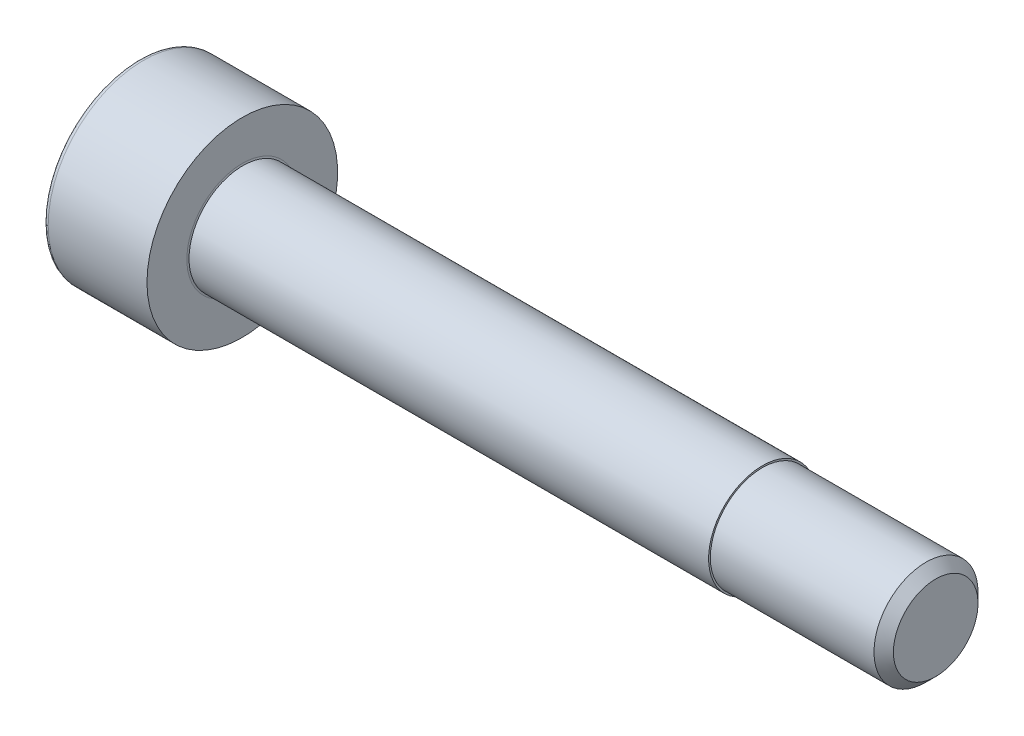
ISO-10303-21;
HEADER;
FILE_DESCRIPTION(('STEP AP214'),'2;1');
FILE_NAME('part.step','',(''),(''),'','','');
FILE_SCHEMA(('AUTOMOTIVE_DESIGN { 1 0 10303 214 1 1 1 1 }'));
ENDSEC;
DATA;
#1=APPLICATION_CONTEXT('core data for automotive mechanical design processes');
#2=APPLICATION_PROTOCOL_DEFINITION('international standard','automotive_design',2000,#1);
#3=PRODUCT_CONTEXT('',#1,'mechanical');
#4=PRODUCT('Part','Part','',(#3));
#5=PRODUCT_RELATED_PRODUCT_CATEGORY('part','',(#4));
#6=PRODUCT_DEFINITION_FORMATION('','',#4);
#7=PRODUCT_DEFINITION_CONTEXT('part definition',#1,'design');
#8=PRODUCT_DEFINITION('design','',#6,#7);
#9=PRODUCT_DEFINITION_SHAPE('','',#8);
#10=(LENGTH_UNIT() NAMED_UNIT(*) SI_UNIT(.MILLI.,.METRE.));
#11=(NAMED_UNIT(*) PLANE_ANGLE_UNIT() SI_UNIT($,.RADIAN.));
#12=(NAMED_UNIT(*) SI_UNIT($,.STERADIAN.) SOLID_ANGLE_UNIT());
#13=UNCERTAINTY_MEASURE_WITH_UNIT(LENGTH_MEASURE(1.E-05),#10,'distance_accuracy_value','');
#14=(GEOMETRIC_REPRESENTATION_CONTEXT(3) GLOBAL_UNCERTAINTY_ASSIGNED_CONTEXT((#13)) GLOBAL_UNIT_ASSIGNED_CONTEXT((#10,
#11,#12)) REPRESENTATION_CONTEXT('',''));
#15=CARTESIAN_POINT('',(0.,0.,0.));
#16=DIRECTION('',(0.,0.,1.));
#17=DIRECTION('',(1.,0.,0.));
#18=AXIS2_PLACEMENT_3D('',#15,#16,#17);
#19=CARTESIAN_POINT('',(3.1,0.,0.));
#20=DIRECTION('',(1.,0.,0.));
#21=DIRECTION('',(0.,0.,-1.));
#22=AXIS2_PLACEMENT_3D('',#19,#20,#21);
#23=TOROIDAL_SURFACE('',#22,1.59999999999999,0.1);
#24=CARTESIAN_POINT('',(3.,0.,0.));
#25=DIRECTION('',(1.,0.,0.));
#26=DIRECTION('',(0.,0.,-1.));
#27=AXIS2_PLACEMENT_3D('',#24,#25,#26);
#28=CIRCLE('',#27,1.59999999999999);
#29=CARTESIAN_POINT('',(3.,0.,-1.59999999999999));
#30=VERTEX_POINT('',#29);
#31=EDGE_CURVE('E152',#30,#30,#28,.F.);
#32=ORIENTED_EDGE('',*,*,#31,.F.);
#33=EDGE_LOOP('',(#32));
#34=FACE_BOUND('',#33,.T.);
#35=CARTESIAN_POINT('',(3.01339745962155,0.,0.));
#36=DIRECTION('',(1.,0.,0.));
#37=DIRECTION('',(0.,0.,-1.));
#38=AXIS2_PLACEMENT_3D('',#35,#36,#37);
#39=CIRCLE('',#38,1.55);
#40=CARTESIAN_POINT('',(3.01339745962155,0.,-1.55));
#41=VERTEX_POINT('',#40);
#42=EDGE_CURVE('E43',#41,#41,#39,.T.);
#43=ORIENTED_EDGE('',*,*,#42,.F.);
#44=EDGE_LOOP('',(#43));
#45=FACE_BOUND('',#44,.T.);
#46=ADVANCED_FACE('F35',(#34,#45),#23,.F.);
#47=CARTESIAN_POINT('',(0.,0.,0.));
#48=DIRECTION('',(-1.,0.,0.));
#49=DIRECTION('',(0.,0.,1.));
#50=AXIS2_PLACEMENT_3D('',#47,#48,#49);
#51=PLANE('',#50);
#52=DIRECTION('',(0.,-0.499999999999999,0.866025403784439));
#53=VECTOR('',#52,1.);
#54=CARTESIAN_POINT('',(0.,1.47801668912544,0.));
#55=LINE('',#54,#53);
#56=CARTESIAN_POINT('',(0.,1.47801668912544,0.));
#57=VERTEX_POINT('',#56);
#58=CARTESIAN_POINT('',(0.,0.73900834456272,1.28));
#59=VERTEX_POINT('',#58);
#60=EDGE_CURVE('E239',#57,#59,#55,.T.);
#61=ORIENTED_EDGE('',*,*,#60,.T.);
#62=DIRECTION('',(0.,1.,0.));
#63=VECTOR('',#62,1.);
#64=CARTESIAN_POINT('',(0.,-0.739008344562723,1.28));
#65=LINE('',#64,#63);
#66=CARTESIAN_POINT('',(0.,-0.739008344562723,1.28));
#67=VERTEX_POINT('',#66);
#68=EDGE_CURVE('E131',#67,#59,#65,.T.);
#69=ORIENTED_EDGE('',*,*,#68,.F.);
#70=DIRECTION('',(0.,-0.500000000000001,-0.866025403784438));
#71=VECTOR('',#70,1.);
#72=CARTESIAN_POINT('',(0.,-0.739008344562723,1.28));
#73=LINE('',#72,#71);
#74=CARTESIAN_POINT('',(0.,-1.47801668912545,0.));
#75=VERTEX_POINT('',#74);
#76=EDGE_CURVE('E259',#67,#75,#73,.T.);
#77=ORIENTED_EDGE('',*,*,#76,.T.);
#78=DIRECTION('',(0.,0.499999999999999,-0.866025403784439));
#79=VECTOR('',#78,1.);
#80=CARTESIAN_POINT('',(0.,-1.47801668912545,0.));
#81=LINE('',#80,#79);
#82=CARTESIAN_POINT('',(0.,-0.739008344562727,-1.28));
#83=VERTEX_POINT('',#82);
#84=EDGE_CURVE('E262',#75,#83,#81,.T.);
#85=ORIENTED_EDGE('',*,*,#84,.T.);
#86=DIRECTION('',(0.,-1.,0.));
#87=VECTOR('',#86,1.);
#88=CARTESIAN_POINT('',(0.,0.739008344562717,-1.28));
#89=LINE('',#88,#87);
#90=CARTESIAN_POINT('',(0.,0.739008344562717,-1.28));
#91=VERTEX_POINT('',#90);
#92=EDGE_CURVE('E265',#91,#83,#89,.T.);
#93=ORIENTED_EDGE('',*,*,#92,.F.);
#94=DIRECTION('',(0.,-0.500000000000001,-0.866025403784438));
#95=VECTOR('',#94,1.);
#96=CARTESIAN_POINT('',(0.,1.47801668912544,0.));
#97=LINE('',#96,#95);
#98=EDGE_CURVE('E126',#57,#91,#97,.T.);
#99=ORIENTED_EDGE('',*,*,#98,.F.);
#100=EDGE_LOOP('',(#61,#69,#77,#85,#93,#99));
#101=FACE_BOUND('',#100,.T.);
#102=CARTESIAN_POINT('',(0.,0.,0.));
#103=DIRECTION('',(-1.,0.,0.));
#104=DIRECTION('',(0.,0.,1.));
#105=AXIS2_PLACEMENT_3D('',#102,#103,#104);
#106=CIRCLE('',#105,2.6);
#107=CARTESIAN_POINT('',(0.,0.,2.6));
#108=VERTEX_POINT('',#107);
#109=EDGE_CURVE('E155',#108,#108,#106,.T.);
#110=ORIENTED_EDGE('',*,*,#109,.T.);
#111=EDGE_LOOP('',(#110));
#112=FACE_BOUND('',#111,.T.);
#113=ADVANCED_FACE('F166',(#101,#112),#51,.T.);
#114=CARTESIAN_POINT('',(-31.75,0.,0.));
#115=DIRECTION('',(-1.,0.,0.));
#116=DIRECTION('',(0.,0.,1.));
#117=AXIS2_PLACEMENT_3D('',#114,#115,#116);
#118=CYLINDRICAL_SURFACE('',#117,2.75);
#119=CARTESIAN_POINT('',(0.149999999999997,0.,0.));
#120=DIRECTION('',(-1.,0.,0.));
#121=DIRECTION('',(0.,0.,1.));
#122=AXIS2_PLACEMENT_3D('',#119,#120,#121);
#123=CIRCLE('',#122,2.75);
#124=CARTESIAN_POINT('',(0.149999999999997,0.,2.75));
#125=VERTEX_POINT('',#124);
#126=EDGE_CURVE('E158',#125,#125,#123,.F.);
#127=ORIENTED_EDGE('',*,*,#126,.T.);
#128=EDGE_LOOP('',(#127));
#129=FACE_BOUND('',#128,.T.);
#130=CARTESIAN_POINT('',(3.,0.,0.));
#131=DIRECTION('',(-1.,0.,0.));
#132=DIRECTION('',(0.,0.,1.));
#133=AXIS2_PLACEMENT_3D('',#130,#131,#132);
#134=CIRCLE('',#133,2.75);
#135=CARTESIAN_POINT('',(3.,0.,2.75));
#136=VERTEX_POINT('',#135);
#137=EDGE_CURVE('E149',#136,#136,#134,.T.);
#138=ORIENTED_EDGE('',*,*,#137,.T.);
#139=EDGE_LOOP('',(#138));
#140=FACE_BOUND('',#139,.T.);
#141=ADVANCED_FACE('F173',(#129,#140),#118,.T.);
#142=CARTESIAN_POINT('',(3.,2.75,0.));
#143=DIRECTION('',(1.,0.,0.));
#144=DIRECTION('',(0.,0.,-1.));
#145=AXIS2_PLACEMENT_3D('',#142,#143,#144);
#146=PLANE('',#145);
#147=ORIENTED_EDGE('',*,*,#31,.T.);
#148=EDGE_LOOP('',(#147));
#149=FACE_BOUND('',#148,.T.);
#150=ORIENTED_EDGE('',*,*,#137,.F.);
#151=EDGE_LOOP('',(#150));
#152=FACE_BOUND('',#151,.T.);
#153=ADVANCED_FACE('F180',(#149,#152),#146,.T.);
#154=CARTESIAN_POINT('',(0.149999999999997,0.,0.));
#155=DIRECTION('',(-1.,0.,0.));
#156=DIRECTION('',(0.,0.,1.));
#157=AXIS2_PLACEMENT_3D('',#154,#155,#156);
#158=TOROIDAL_SURFACE('',#157,2.6,0.15);
#159=ORIENTED_EDGE('',*,*,#126,.F.);
#160=EDGE_LOOP('',(#159));
#161=FACE_BOUND('',#160,.T.);
#162=ORIENTED_EDGE('',*,*,#109,.F.);
#163=EDGE_LOOP('',(#162));
#164=FACE_BOUND('',#163,.T.);
#165=ADVANCED_FACE('F37',(#161,#164),#158,.T.);
#166=CARTESIAN_POINT('',(1.3,1.47801668912544,0.));
#167=DIRECTION('',(0.,-0.866025403784439,-0.499999999999999));
#168=DIRECTION('',(0.,0.499999999999999,-0.866025403784439));
#169=AXIS2_PLACEMENT_3D('',#166,#167,#168);
#170=PLANE('',#169);
#171=ORIENTED_EDGE('',*,*,#60,.F.);
#172=DIRECTION('',(-1.,0.,0.));
#173=VECTOR('',#172,1.);
#174=CARTESIAN_POINT('',(1.3,1.47801668912544,0.));
#175=LINE('',#174,#173);
#176=CARTESIAN_POINT('',(1.3,1.47801668912544,0.));
#177=VERTEX_POINT('',#176);
#178=EDGE_CURVE('E256',#177,#57,#175,.T.);
#179=ORIENTED_EDGE('',*,*,#178,.F.);
#180=DIRECTION('',(0.,-0.499999999999999,0.866025403784439));
#181=VECTOR('',#180,1.);
#182=CARTESIAN_POINT('',(1.3,1.47801668912544,0.));
#183=LINE('',#182,#181);
#184=CARTESIAN_POINT('',(1.3,1.10851251684408,0.639999999999997));
#185=VERTEX_POINT('',#184);
#186=EDGE_CURVE('E118',#177,#185,#183,.T.);
#187=ORIENTED_EDGE('',*,*,#186,.T.);
#188=CARTESIAN_POINT('',(1.3,0.73900834456272,1.28));
#189=VERTEX_POINT('',#188);
#190=EDGE_CURVE('E109',#185,#189,#183,.T.);
#191=ORIENTED_EDGE('',*,*,#190,.T.);
#192=DIRECTION('',(-1.,0.,0.));
#193=VECTOR('',#192,1.);
#194=CARTESIAN_POINT('',(1.3,0.73900834456272,1.28));
#195=LINE('',#194,#193);
#196=EDGE_CURVE('E123',#189,#59,#195,.T.);
#197=ORIENTED_EDGE('',*,*,#196,.T.);
#198=EDGE_LOOP('',(#171,#179,#187,#191,#197));
#199=FACE_BOUND('',#198,.T.);
#200=ADVANCED_FACE('F122',(#199),#170,.T.);
#201=CARTESIAN_POINT('',(1.3,-0.739008344562723,1.28));
#202=DIRECTION('',(0.,0.,1.));
#203=DIRECTION('',(0.,-1.,0.));
#204=AXIS2_PLACEMENT_3D('',#201,#202,#203);
#205=PLANE('',#204);
#206=ORIENTED_EDGE('',*,*,#68,.T.);
#207=ORIENTED_EDGE('',*,*,#196,.F.);
#208=DIRECTION('',(0.,1.,0.));
#209=VECTOR('',#208,1.);
#210=CARTESIAN_POINT('',(1.3,-0.739008344562723,1.28));
#211=LINE('',#210,#209);
#212=CARTESIAN_POINT('',(1.3,0.,1.28));
#213=VERTEX_POINT('',#212);
#214=EDGE_CURVE('E106',#213,#189,#211,.T.);
#215=ORIENTED_EDGE('',*,*,#214,.F.);
#216=CARTESIAN_POINT('',(1.3,-0.739008344562723,1.28));
#217=VERTEX_POINT('',#216);
#218=EDGE_CURVE('E117',#217,#213,#211,.T.);
#219=ORIENTED_EDGE('',*,*,#218,.F.);
#220=DIRECTION('',(-1.,0.,0.));
#221=VECTOR('',#220,1.);
#222=CARTESIAN_POINT('',(1.3,-0.739008344562723,1.28));
#223=LINE('',#222,#221);
#224=EDGE_CURVE('E133',#217,#67,#223,.T.);
#225=ORIENTED_EDGE('',*,*,#224,.T.);
#226=EDGE_LOOP('',(#206,#207,#215,#219,#225));
#227=FACE_BOUND('',#226,.T.);
#228=ADVANCED_FACE('F128',(#227),#205,.F.);
#229=CARTESIAN_POINT('',(1.3,-0.739008344562723,1.28));
#230=DIRECTION('',(0.,0.866025403784438,-0.500000000000001));
#231=DIRECTION('',(0.,0.500000000000001,0.866025403784438));
#232=AXIS2_PLACEMENT_3D('',#229,#230,#231);
#233=PLANE('',#232);
#234=ORIENTED_EDGE('',*,*,#76,.F.);
#235=ORIENTED_EDGE('',*,*,#224,.F.);
#236=DIRECTION('',(0.,-0.500000000000001,-0.866025403784438));
#237=VECTOR('',#236,1.);
#238=CARTESIAN_POINT('',(1.3,-0.739008344562723,1.28));
#239=LINE('',#238,#237);
#240=CARTESIAN_POINT('',(1.3,-1.10851251684408,0.640000000000002));
#241=VERTEX_POINT('',#240);
#242=EDGE_CURVE('E244',#217,#241,#239,.T.);
#243=ORIENTED_EDGE('',*,*,#242,.T.);
#244=CARTESIAN_POINT('',(1.3,-1.47801668912545,0.));
#245=VERTEX_POINT('',#244);
#246=EDGE_CURVE('E243',#241,#245,#239,.T.);
#247=ORIENTED_EDGE('',*,*,#246,.T.);
#248=DIRECTION('',(-1.,0.,0.));
#249=VECTOR('',#248,1.);
#250=CARTESIAN_POINT('',(1.3,-1.47801668912545,0.));
#251=LINE('',#250,#249);
#252=EDGE_CURVE('E138',#245,#75,#251,.T.);
#253=ORIENTED_EDGE('',*,*,#252,.T.);
#254=EDGE_LOOP('',(#234,#235,#243,#247,#253));
#255=FACE_BOUND('',#254,.T.);
#256=ADVANCED_FACE('F206',(#255),#233,.T.);
#257=CARTESIAN_POINT('',(1.3,-1.47801668912545,0.));
#258=DIRECTION('',(0.,0.866025403784439,0.499999999999999));
#259=DIRECTION('',(0.,-0.499999999999999,0.866025403784439));
#260=AXIS2_PLACEMENT_3D('',#257,#258,#259);
#261=PLANE('',#260);
#262=ORIENTED_EDGE('',*,*,#84,.F.);
#263=ORIENTED_EDGE('',*,*,#252,.F.);
#264=DIRECTION('',(0.,0.499999999999999,-0.866025403784439));
#265=VECTOR('',#264,1.);
#266=CARTESIAN_POINT('',(1.3,-1.47801668912545,0.));
#267=LINE('',#266,#265);
#268=CARTESIAN_POINT('',(1.3,-1.10851251684409,-0.640000000000001));
#269=VERTEX_POINT('',#268);
#270=EDGE_CURVE('E248',#245,#269,#267,.T.);
#271=ORIENTED_EDGE('',*,*,#270,.T.);
#272=CARTESIAN_POINT('',(1.3,-0.739008344562727,-1.28));
#273=VERTEX_POINT('',#272);
#274=EDGE_CURVE('E247',#269,#273,#267,.T.);
#275=ORIENTED_EDGE('',*,*,#274,.T.);
#276=DIRECTION('',(-1.,0.,0.));
#277=VECTOR('',#276,1.);
#278=CARTESIAN_POINT('',(1.3,-0.739008344562727,-1.28));
#279=LINE('',#278,#277);
#280=EDGE_CURVE('E274',#273,#83,#279,.T.);
#281=ORIENTED_EDGE('',*,*,#280,.T.);
#282=EDGE_LOOP('',(#262,#263,#271,#275,#281));
#283=FACE_BOUND('',#282,.T.);
#284=ADVANCED_FACE('F209',(#283),#261,.T.);
#285=CARTESIAN_POINT('',(1.3,0.739008344562717,-1.28));
#286=DIRECTION('',(0.,0.,-1.));
#287=DIRECTION('',(0.,1.,0.));
#288=AXIS2_PLACEMENT_3D('',#285,#286,#287);
#289=PLANE('',#288);
#290=ORIENTED_EDGE('',*,*,#92,.T.);
#291=ORIENTED_EDGE('',*,*,#280,.F.);
#292=DIRECTION('',(0.,-1.,0.));
#293=VECTOR('',#292,1.);
#294=CARTESIAN_POINT('',(1.3,0.739008344562717,-1.28));
#295=LINE('',#294,#293);
#296=CARTESIAN_POINT('',(1.3,0.,-1.28));
#297=VERTEX_POINT('',#296);
#298=EDGE_CURVE('E251',#297,#273,#295,.T.);
#299=ORIENTED_EDGE('',*,*,#298,.F.);
#300=CARTESIAN_POINT('',(1.3,0.739008344562717,-1.28));
#301=VERTEX_POINT('',#300);
#302=EDGE_CURVE('E50',#301,#297,#295,.T.);
#303=ORIENTED_EDGE('',*,*,#302,.F.);
#304=DIRECTION('',(-1.,0.,0.));
#305=VECTOR('',#304,1.);
#306=CARTESIAN_POINT('',(1.3,0.739008344562717,-1.28));
#307=LINE('',#306,#305);
#308=EDGE_CURVE('E271',#301,#91,#307,.T.);
#309=ORIENTED_EDGE('',*,*,#308,.T.);
#310=EDGE_LOOP('',(#290,#291,#299,#303,#309));
#311=FACE_BOUND('',#310,.T.);
#312=ADVANCED_FACE('F213',(#311),#289,.F.);
#313=CARTESIAN_POINT('',(1.3,1.47801668912544,0.));
#314=DIRECTION('',(0.,0.866025403784438,-0.500000000000001));
#315=DIRECTION('',(0.,0.500000000000001,0.866025403784438));
#316=AXIS2_PLACEMENT_3D('',#313,#314,#315);
#317=PLANE('',#316);
#318=ORIENTED_EDGE('',*,*,#98,.T.);
#319=ORIENTED_EDGE('',*,*,#308,.F.);
#320=DIRECTION('',(0.,-0.500000000000001,-0.866025403784438));
#321=VECTOR('',#320,1.);
#322=CARTESIAN_POINT('',(1.3,1.47801668912544,0.));
#323=LINE('',#322,#321);
#324=CARTESIAN_POINT('',(1.3,1.10851251684408,-0.640000000000001));
#325=VERTEX_POINT('',#324);
#326=EDGE_CURVE('E253',#325,#301,#323,.T.);
#327=ORIENTED_EDGE('',*,*,#326,.F.);
#328=EDGE_CURVE('E254',#177,#325,#323,.T.);
#329=ORIENTED_EDGE('',*,*,#328,.F.);
#330=ORIENTED_EDGE('',*,*,#178,.T.);
#331=EDGE_LOOP('',(#318,#319,#327,#329,#330));
#332=FACE_BOUND('',#331,.T.);
#333=ADVANCED_FACE('F217',(#332),#317,.F.);
#334=CARTESIAN_POINT('',(1.3,1.47801668912544,0.));
#335=DIRECTION('',(1.,0.,0.));
#336=DIRECTION('',(0.,0.,-1.));
#337=AXIS2_PLACEMENT_3D('',#334,#335,#336);
#338=PLANE('',#337);
#339=ORIENTED_EDGE('',*,*,#298,.T.);
#340=ORIENTED_EDGE('',*,*,#274,.F.);
#341=CARTESIAN_POINT('',(1.3,0.,0.));
#342=DIRECTION('',(-1.,0.,0.));
#343=DIRECTION('',(0.,0.,1.));
#344=AXIS2_PLACEMENT_3D('',#341,#342,#343);
#345=CIRCLE('',#344,1.28);
#346=EDGE_CURVE('E292',#297,#269,#345,.T.);
#347=ORIENTED_EDGE('',*,*,#346,.F.);
#348=EDGE_LOOP('',(#339,#340,#347));
#349=FACE_BOUND('',#348,.T.);
#350=ADVANCED_FACE('F221',(#349),#338,.F.);
#351=ORIENTED_EDGE('',*,*,#270,.F.);
#352=ORIENTED_EDGE('',*,*,#246,.F.);
#353=EDGE_CURVE('E136',#269,#241,#345,.T.);
#354=ORIENTED_EDGE('',*,*,#353,.F.);
#355=EDGE_LOOP('',(#351,#352,#354));
#356=FACE_BOUND('',#355,.T.);
#357=ADVANCED_FACE('F225',(#356),#338,.F.);
#358=ORIENTED_EDGE('',*,*,#242,.F.);
#359=ORIENTED_EDGE('',*,*,#218,.T.);
#360=EDGE_CURVE('E132',#241,#213,#345,.T.);
#361=ORIENTED_EDGE('',*,*,#360,.F.);
#362=EDGE_LOOP('',(#358,#359,#361));
#363=FACE_BOUND('',#362,.T.);
#364=ADVANCED_FACE('F301',(#363),#338,.F.);
#365=ORIENTED_EDGE('',*,*,#214,.T.);
#366=ORIENTED_EDGE('',*,*,#190,.F.);
#367=EDGE_CURVE('E112',#213,#185,#345,.T.);
#368=ORIENTED_EDGE('',*,*,#367,.F.);
#369=EDGE_LOOP('',(#365,#366,#368));
#370=FACE_BOUND('',#369,.T.);
#371=ADVANCED_FACE('F108',(#370),#338,.F.);
#372=ORIENTED_EDGE('',*,*,#186,.F.);
#373=ORIENTED_EDGE('',*,*,#328,.T.);
#374=EDGE_CURVE('E143',#185,#325,#345,.T.);
#375=ORIENTED_EDGE('',*,*,#374,.F.);
#376=EDGE_LOOP('',(#372,#373,#375));
#377=FACE_BOUND('',#376,.T.);
#378=ADVANCED_FACE('F287',(#377),#338,.F.);
#379=ORIENTED_EDGE('',*,*,#326,.T.);
#380=ORIENTED_EDGE('',*,*,#302,.T.);
#381=EDGE_CURVE('E291',#325,#297,#345,.T.);
#382=ORIENTED_EDGE('',*,*,#381,.F.);
#383=EDGE_LOOP('',(#379,#380,#382));
#384=FACE_BOUND('',#383,.T.);
#385=ADVANCED_FACE('F201',(#384),#338,.F.);
#386=CARTESIAN_POINT('',(1.3,0.,0.));
#387=DIRECTION('',(-1.,0.,0.));
#388=DIRECTION('',(0.,0.,1.));
#389=AXIS2_PLACEMENT_3D('',#386,#387,#388);
#390=CONICAL_SURFACE('',#389,1.28,1.04719755119659);
#391=CARTESIAN_POINT('',(2.03900834456273,0.,0.));
#392=VERTEX_POINT('',#391);
#393=VERTEX_LOOP('',#392);
#394=FACE_BOUND('',#393,.T.);
#395=ORIENTED_EDGE('',*,*,#367,.T.);
#396=ORIENTED_EDGE('',*,*,#374,.T.);
#397=ORIENTED_EDGE('',*,*,#381,.T.);
#398=ORIENTED_EDGE('',*,*,#346,.T.);
#399=ORIENTED_EDGE('',*,*,#353,.T.);
#400=ORIENTED_EDGE('',*,*,#360,.T.);
#401=EDGE_LOOP('',(#395,#396,#397,#398,#399,#400));
#402=FACE_BOUND('',#401,.T.);
#403=ADVANCED_FACE('F198',(#394,#402),#390,.F.);
#404=CARTESIAN_POINT('',(18.,0.,0.));
#405=DIRECTION('',(-1.,0.,0.));
#406=DIRECTION('',(0.,0.,1.));
#407=AXIS2_PLACEMENT_3D('',#404,#405,#406);
#408=CYLINDRICAL_SURFACE('',#407,1.55);
#409=CARTESIAN_POINT('',(18.,0.,0.));
#410=DIRECTION('',(1.,0.,0.));
#411=DIRECTION('',(0.,0.,-1.));
#412=AXIS2_PLACEMENT_3D('',#409,#410,#411);
#413=CIRCLE('',#412,1.55);
#414=CARTESIAN_POINT('',(18.,0.,-1.55));
#415=VERTEX_POINT('',#414);
#416=EDGE_CURVE('E238',#415,#415,#413,.T.);
#417=ORIENTED_EDGE('',*,*,#416,.F.);
#418=EDGE_LOOP('',(#417));
#419=FACE_BOUND('',#418,.T.);
#420=ORIENTED_EDGE('',*,*,#42,.T.);
#421=EDGE_LOOP('',(#420));
#422=FACE_BOUND('',#421,.T.);
#423=ADVANCED_FACE('F163',(#419,#422),#408,.T.);
#424=CARTESIAN_POINT('',(18.,0.,0.));
#425=DIRECTION('',(1.,0.,0.));
#426=DIRECTION('',(0.,0.,-1.));
#427=AXIS2_PLACEMENT_3D('',#424,#425,#426);
#428=PLANE('',#427);
#429=CARTESIAN_POINT('',(18.,0.,0.));
#430=DIRECTION('',(1.,0.,0.));
#431=DIRECTION('',(0.,0.,-1.));
#432=AXIS2_PLACEMENT_3D('',#429,#430,#431);
#433=CIRCLE('',#432,1.49999999999999);
#434=CARTESIAN_POINT('',(18.,0.,-1.49999999999999));
#435=VERTEX_POINT('',#434);
#436=EDGE_CURVE('E11',#435,#435,#433,.F.);
#437=ORIENTED_EDGE('',*,*,#436,.T.);
#438=EDGE_LOOP('',(#437));
#439=FACE_BOUND('',#438,.T.);
#440=ORIENTED_EDGE('',*,*,#416,.T.);
#441=EDGE_LOOP('',(#440));
#442=FACE_BOUND('',#441,.T.);
#443=ADVANCED_FACE('F196',(#439,#442),#428,.T.);
#444=CARTESIAN_POINT('',(23.,1.2195,0.));
#445=DIRECTION('',(1.,0.,0.));
#446=DIRECTION('',(0.,0.,-1.));
#447=AXIS2_PLACEMENT_3D('',#444,#445,#446);
#448=PLANE('',#447);
#449=CARTESIAN_POINT('',(23.,0.,0.));
#450=DIRECTION('',(-1.,0.,0.));
#451=DIRECTION('',(0.,0.,1.));
#452=AXIS2_PLACEMENT_3D('',#449,#450,#451);
#453=CIRCLE('',#452,1.2195);
#454=CARTESIAN_POINT('',(23.,0.,1.2195));
#455=VERTEX_POINT('',#454);
#456=EDGE_CURVE('E142',#455,#455,#453,.T.);
#457=ORIENTED_EDGE('',*,*,#456,.F.);
#458=EDGE_LOOP('',(#457));
#459=FACE_BOUND('',#458,.T.);
#460=ADVANCED_FACE('F192',(#459),#448,.T.);
#461=CARTESIAN_POINT('',(23.,0.,0.));
#462=DIRECTION('',(-1.,0.,0.));
#463=DIRECTION('',(0.,0.,1.));
#464=AXIS2_PLACEMENT_3D('',#461,#462,#463);
#465=CONICAL_SURFACE('',#464,1.2195,0.785398163397391);
#466=CARTESIAN_POINT('',(22.7195,0.,0.));
#467=DIRECTION('',(-1.,0.,0.));
#468=DIRECTION('',(0.,0.,1.));
#469=AXIS2_PLACEMENT_3D('',#466,#467,#468);
#470=CIRCLE('',#469,1.49999999999998);
#471=CARTESIAN_POINT('',(22.7195,0.,1.49999999999998));
#472=VERTEX_POINT('',#471);
#473=EDGE_CURVE('E146',#472,#472,#470,.T.);
#474=ORIENTED_EDGE('',*,*,#473,.F.);
#475=EDGE_LOOP('',(#474));
#476=FACE_BOUND('',#475,.T.);
#477=ORIENTED_EDGE('',*,*,#456,.T.);
#478=EDGE_LOOP('',(#477));
#479=FACE_BOUND('',#478,.T.);
#480=ADVANCED_FACE('F188',(#476,#479),#465,.T.);
#481=CARTESIAN_POINT('',(-31.75,0.,0.));
#482=DIRECTION('',(-1.,0.,0.));
#483=DIRECTION('',(0.,0.,1.));
#484=AXIS2_PLACEMENT_3D('',#481,#482,#483);
#485=CYLINDRICAL_SURFACE('',#484,1.49999999999999);
#486=ORIENTED_EDGE('',*,*,#436,.F.);
#487=EDGE_LOOP('',(#486));
#488=FACE_BOUND('',#487,.T.);
#489=ORIENTED_EDGE('',*,*,#473,.T.);
#490=EDGE_LOOP('',(#489));
#491=FACE_BOUND('',#490,.T.);
#492=ADVANCED_FACE('F185',(#488,#491),#485,.T.);
#493=CLOSED_SHELL('',(#46,#113,#141,#153,#165,#200,#228,#256,#284,#312,#333,#350,#357,#364,#371,
#378,#385,#403,#423,#443,#460,#480,#492));
#494=MANIFOLD_SOLID_BREP('B2',#493);
#495=ADVANCED_BREP_SHAPE_REPRESENTATION('',(#18,#494),#14);
#496=SHAPE_DEFINITION_REPRESENTATION(#9,#495);
ENDSEC;
END-ISO-10303-21;
